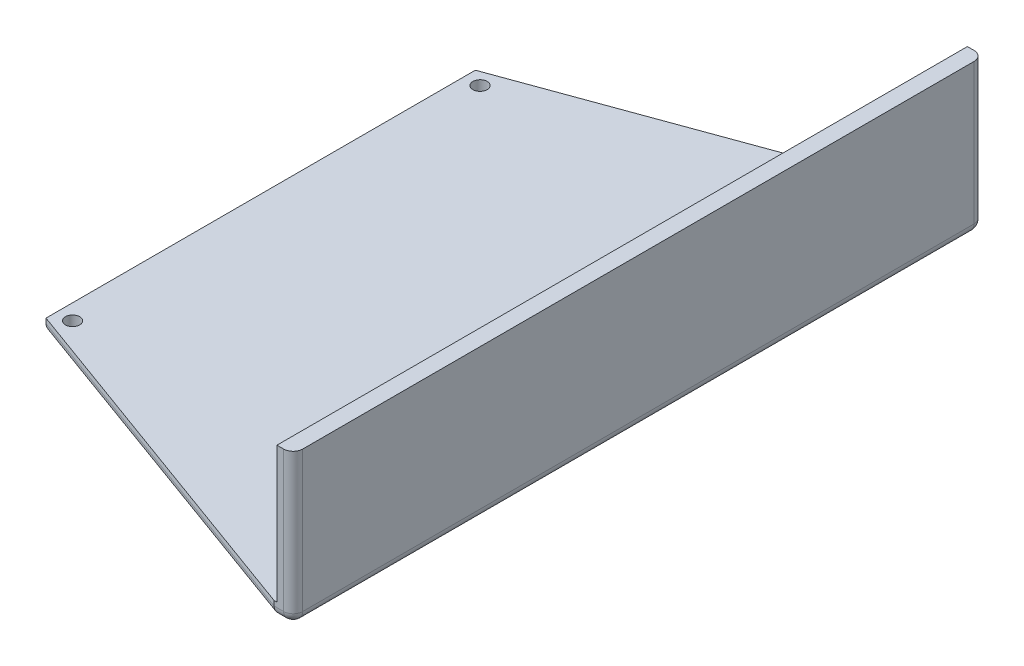
ISO-10303-21;
HEADER;
FILE_DESCRIPTION(('STEP AP214'),'2;1');
FILE_NAME('part.step','',(''),(''),'','','');
FILE_SCHEMA(('AUTOMOTIVE_DESIGN { 1 0 10303 214 1 1 1 1 }'));
ENDSEC;
DATA;
#1=APPLICATION_CONTEXT('core data for automotive mechanical design processes');
#2=APPLICATION_PROTOCOL_DEFINITION('international standard','automotive_design',2000,#1);
#3=PRODUCT_CONTEXT('',#1,'mechanical');
#4=PRODUCT('Part','Part','',(#3));
#5=PRODUCT_RELATED_PRODUCT_CATEGORY('part','',(#4));
#6=PRODUCT_DEFINITION_FORMATION('','',#4);
#7=PRODUCT_DEFINITION_CONTEXT('part definition',#1,'design');
#8=PRODUCT_DEFINITION('design','',#6,#7);
#9=PRODUCT_DEFINITION_SHAPE('','',#8);
#10=(LENGTH_UNIT() NAMED_UNIT(*) SI_UNIT(.MILLI.,.METRE.));
#11=(NAMED_UNIT(*) PLANE_ANGLE_UNIT() SI_UNIT($,.RADIAN.));
#12=(NAMED_UNIT(*) SI_UNIT($,.STERADIAN.) SOLID_ANGLE_UNIT());
#13=UNCERTAINTY_MEASURE_WITH_UNIT(LENGTH_MEASURE(1.E-05),#10,'distance_accuracy_value','');
#14=(GEOMETRIC_REPRESENTATION_CONTEXT(3) GLOBAL_UNCERTAINTY_ASSIGNED_CONTEXT((#13)) GLOBAL_UNIT_ASSIGNED_CONTEXT((#10,
#11,#12)) REPRESENTATION_CONTEXT('',''));
#15=CARTESIAN_POINT('',(0.,0.,0.));
#16=DIRECTION('',(0.,0.,1.));
#17=DIRECTION('',(1.,0.,0.));
#18=AXIS2_PLACEMENT_3D('',#15,#16,#17);
#19=CARTESIAN_POINT('',(0.,0.,0.));
#20=DIRECTION('',(0.,1.,0.));
#21=DIRECTION('',(0.,0.,1.));
#22=AXIS2_PLACEMENT_3D('',#19,#20,#21);
#23=PLANE('',#22);
#24=CARTESIAN_POINT('',(-75.8993879918341,0.,42.7056942545958));
#25=DIRECTION('',(0.,1.,0.));
#26=DIRECTION('',(0.,0.,1.));
#27=AXIS2_PLACEMENT_3D('',#24,#25,#26);
#28=CIRCLE('',#27,1.5);
#29=CARTESIAN_POINT('',(-75.5958137522718,0.,44.1746539821153));
#30=VERTEX_POINT('',#29);
#31=CARTESIAN_POINT('',(-77.17599616899,0.,41.9181210440188));
#32=VERTEX_POINT('',#31);
#33=EDGE_CURVE('E206',#30,#32,#28,.T.);
#34=ORIENTED_EDGE('',*,*,#33,.T.);
#35=DIRECTION('',(0.,0.,1.));
#36=VECTOR('',#35,1.);
#37=CARTESIAN_POINT('',(-77.17599616899,0.,0.));
#38=LINE('',#37,#36);
#39=CARTESIAN_POINT('',(-77.17599616899,0.,-41.9181210440188));
#40=VERTEX_POINT('',#39);
#41=EDGE_CURVE('E238',#32,#40,#38,.F.);
#42=ORIENTED_EDGE('',*,*,#41,.T.);
#43=CARTESIAN_POINT('',(-75.8993879918341,0.,-42.7056942545958));
#44=DIRECTION('',(0.,1.,0.));
#45=DIRECTION('',(0.,0.,1.));
#46=AXIS2_PLACEMENT_3D('',#43,#44,#45);
#47=CIRCLE('',#46,1.5);
#48=CARTESIAN_POINT('',(-75.5958137522719,0.,-44.1746539821153));
#49=VERTEX_POINT('',#48);
#50=EDGE_CURVE('E210',#40,#49,#47,.T.);
#51=ORIENTED_EDGE('',*,*,#50,.T.);
#52=DIRECTION('',(-0.939699952112375,0.,0.342));
#53=VECTOR('',#52,1.);
#54=CARTESIAN_POINT('',(-23.0387234789192,0.,-63.302594590265));
#55=LINE('',#54,#53);
#56=CARTESIAN_POINT('',(-3.64736814100806,0.,-70.36));
#57=VERTEX_POINT('',#56);
#58=EDGE_CURVE('E217',#49,#57,#55,.F.);
#59=ORIENTED_EDGE('',*,*,#58,.T.);
#60=DIRECTION('',(-1.,0.,0.));
#61=VECTOR('',#60,1.);
#62=CARTESIAN_POINT('',(0.,0.,-70.36));
#63=LINE('',#62,#61);
#64=CARTESIAN_POINT('',(-2.,0.,-70.36));
#65=VERTEX_POINT('',#64);
#66=EDGE_CURVE('E219',#57,#65,#63,.F.);
#67=ORIENTED_EDGE('',*,*,#66,.T.);
#68=DIRECTION('',(0.,0.,-1.));
#69=VECTOR('',#68,1.);
#70=CARTESIAN_POINT('',(-2.,0.,0.));
#71=LINE('',#70,#69);
#72=CARTESIAN_POINT('',(-2.,0.,70.36));
#73=VERTEX_POINT('',#72);
#74=EDGE_CURVE('E222',#65,#73,#71,.F.);
#75=ORIENTED_EDGE('',*,*,#74,.T.);
#76=DIRECTION('',(1.,0.,0.));
#77=VECTOR('',#76,1.);
#78=CARTESIAN_POINT('',(0.,0.,70.36));
#79=LINE('',#78,#77);
#80=CARTESIAN_POINT('',(-3.64736814100806,0.,70.36));
#81=VERTEX_POINT('',#80);
#82=EDGE_CURVE('E225',#73,#81,#79,.F.);
#83=ORIENTED_EDGE('',*,*,#82,.T.);
#84=DIRECTION('',(0.939699952112375,0.,0.342));
#85=VECTOR('',#84,1.);
#86=CARTESIAN_POINT('',(-23.0387234789192,0.,63.302594590265));
#87=LINE('',#86,#85);
#88=EDGE_CURVE('E227',#81,#30,#87,.F.);
#89=ORIENTED_EDGE('',*,*,#88,.T.);
#90=EDGE_LOOP('',(#34,#42,#51,#59,#67,#75,#83,#89));
#91=FACE_BOUND('',#90,.T.);
#92=ADVANCED_FACE('F36',(#91),#23,.F.);
#93=DIRECTION('',(0.939699952112375,0.,0.342));
#94=VECTOR('',#93,1.);
#95=CARTESIAN_POINT('',(-23.0387234789192,0.,63.302594590265));
#96=LINE('',#95,#94);
#97=CARTESIAN_POINT('',(-77.0761285844379,0.,43.6358993812848));
#98=VERTEX_POINT('',#97);
#99=CARTESIAN_POINT('',(-77.17599616899,0.,43.5995529774778));
#100=VERTEX_POINT('',#99);
#101=EDGE_CURVE('E233',#98,#100,#96,.F.);
#102=ORIENTED_EDGE('',*,*,#101,.T.);
#103=DIRECTION('',(0.,0.,1.));
#104=VECTOR('',#103,1.);
#105=CARTESIAN_POINT('',(-77.17599616899,0.,0.));
#106=LINE('',#105,#104);
#107=CARTESIAN_POINT('',(-77.17599616899,0.,43.4932674651728));
#108=VERTEX_POINT('',#107);
#109=EDGE_CURVE('E235',#100,#108,#106,.F.);
#110=ORIENTED_EDGE('',*,*,#109,.T.);
#111=EDGE_CURVE('E209',#108,#98,#28,.T.);
#112=ORIENTED_EDGE('',*,*,#111,.T.);
#113=EDGE_LOOP('',(#102,#110,#112));
#114=FACE_BOUND('',#113,.T.);
#115=ADVANCED_FACE('F278',(#114),#23,.F.);
#116=CARTESIAN_POINT('',(-79.17599616899,3.,-45.));
#117=DIRECTION('',(0.342,0.,0.939699952112375));
#118=DIRECTION('',(0.939699952112375,0.,-0.342));
#119=AXIS2_PLACEMENT_3D('',#116,#117,#118);
#120=PLANE('',#119);
#121=DIRECTION('',(0.,-1.,0.));
#122=VECTOR('',#121,1.);
#123=CARTESIAN_POINT('',(-4.,3.,-72.36));
#124=LINE('',#123,#122);
#125=CARTESIAN_POINT('',(-4.,3.,-72.36));
#126=VERTEX_POINT('',#125);
#127=CARTESIAN_POINT('',(-4.,2.,-72.36));
#128=VERTEX_POINT('',#127);
#129=EDGE_CURVE('E193',#126,#128,#124,.T.);
#130=ORIENTED_EDGE('',*,*,#129,.T.);
#131=DIRECTION('',(-0.939699952112375,0.,0.342));
#132=VECTOR('',#131,1.);
#133=CARTESIAN_POINT('',(-79.17599616899,2.,-45.));
#134=LINE('',#133,#132);
#135=CARTESIAN_POINT('',(-79.17599616899,2.,-45.));
#136=VERTEX_POINT('',#135);
#137=EDGE_CURVE('E324',#128,#136,#134,.T.);
#138=ORIENTED_EDGE('',*,*,#137,.T.);
#139=DIRECTION('',(0.,-1.,0.));
#140=VECTOR('',#139,1.);
#141=CARTESIAN_POINT('',(-79.17599616899,3.,-45.));
#142=LINE('',#141,#140);
#143=CARTESIAN_POINT('',(-79.17599616899,3.,-45.));
#144=VERTEX_POINT('',#143);
#145=EDGE_CURVE('E202',#144,#136,#142,.T.);
#146=ORIENTED_EDGE('',*,*,#145,.F.);
#147=DIRECTION('',(-0.939699952112375,0.,0.342));
#148=VECTOR('',#147,1.);
#149=CARTESIAN_POINT('',(-79.17599616899,3.,-45.));
#150=LINE('',#149,#148);
#151=EDGE_CURVE('E182',#126,#144,#150,.T.);
#152=ORIENTED_EDGE('',*,*,#151,.F.);
#153=EDGE_LOOP('',(#130,#138,#146,#152));
#154=FACE_BOUND('',#153,.T.);
#155=ADVANCED_FACE('F295',(#154),#120,.F.);
#156=CARTESIAN_POINT('',(-79.17599616899,3.,-45.));
#157=DIRECTION('',(1.,0.,0.));
#158=DIRECTION('',(0.,0.,-1.));
#159=AXIS2_PLACEMENT_3D('',#156,#157,#158);
#160=PLANE('',#159);
#161=ORIENTED_EDGE('',*,*,#145,.T.);
#162=DIRECTION('',(0.,0.,1.));
#163=VECTOR('',#162,1.);
#164=CARTESIAN_POINT('',(-79.17599616899,2.,-45.));
#165=LINE('',#164,#163);
#166=CARTESIAN_POINT('',(-79.17599616899,2.,45.));
#167=VERTEX_POINT('',#166);
#168=EDGE_CURVE('E205',#136,#167,#165,.T.);
#169=ORIENTED_EDGE('',*,*,#168,.T.);
#170=DIRECTION('',(0.,-1.,0.));
#171=VECTOR('',#170,1.);
#172=CARTESIAN_POINT('',(-79.17599616899,3.,45.));
#173=LINE('',#172,#171);
#174=CARTESIAN_POINT('',(-79.17599616899,3.,45.));
#175=VERTEX_POINT('',#174);
#176=EDGE_CURVE('E199',#175,#167,#173,.T.);
#177=ORIENTED_EDGE('',*,*,#176,.F.);
#178=DIRECTION('',(0.,0.,1.));
#179=VECTOR('',#178,1.);
#180=CARTESIAN_POINT('',(-79.17599616899,3.,-45.));
#181=LINE('',#180,#179);
#182=EDGE_CURVE('E185',#144,#175,#181,.T.);
#183=ORIENTED_EDGE('',*,*,#182,.F.);
#184=EDGE_LOOP('',(#161,#169,#177,#183));
#185=FACE_BOUND('',#184,.T.);
#186=ADVANCED_FACE('F291',(#185),#160,.F.);
#187=CARTESIAN_POINT('',(-79.17599616899,3.,45.));
#188=DIRECTION('',(0.342,0.,-0.939699952112375));
#189=DIRECTION('',(-0.939699952112375,0.,-0.342));
#190=AXIS2_PLACEMENT_3D('',#187,#188,#189);
#191=PLANE('',#190);
#192=ORIENTED_EDGE('',*,*,#176,.T.);
#193=DIRECTION('',(0.939699952112375,0.,0.342));
#194=VECTOR('',#193,1.);
#195=CARTESIAN_POINT('',(-79.17599616899,2.,45.));
#196=LINE('',#195,#194);
#197=CARTESIAN_POINT('',(-4.,2.,72.36));
#198=VERTEX_POINT('',#197);
#199=EDGE_CURVE('E311',#167,#198,#196,.T.);
#200=ORIENTED_EDGE('',*,*,#199,.T.);
#201=DIRECTION('',(0.,-1.,0.));
#202=VECTOR('',#201,1.);
#203=CARTESIAN_POINT('',(-4.,3.,72.36));
#204=LINE('',#203,#202);
#205=CARTESIAN_POINT('',(-4.,3.,72.36));
#206=VERTEX_POINT('',#205);
#207=EDGE_CURVE('E196',#206,#198,#204,.T.);
#208=ORIENTED_EDGE('',*,*,#207,.F.);
#209=DIRECTION('',(0.939699952112375,0.,0.342));
#210=VECTOR('',#209,1.);
#211=CARTESIAN_POINT('',(-79.17599616899,3.,45.));
#212=LINE('',#211,#210);
#213=EDGE_CURVE('E187',#175,#206,#212,.T.);
#214=ORIENTED_EDGE('',*,*,#213,.F.);
#215=EDGE_LOOP('',(#192,#200,#208,#214));
#216=FACE_BOUND('',#215,.T.);
#217=ADVANCED_FACE('F288',(#216),#191,.F.);
#218=CARTESIAN_POINT('',(-4.,3.,72.36));
#219=DIRECTION('',(0.,0.,-1.));
#220=DIRECTION('',(-1.,0.,0.));
#221=AXIS2_PLACEMENT_3D('',#218,#219,#220);
#222=PLANE('',#221);
#223=DIRECTION('',(1.,0.,0.));
#224=VECTOR('',#223,1.);
#225=CARTESIAN_POINT('',(-4.,2.,72.36));
#226=LINE('',#225,#224);
#227=CARTESIAN_POINT('',(-2.,2.,72.36));
#228=VERTEX_POINT('',#227);
#229=EDGE_CURVE('E317',#198,#228,#226,.T.);
#230=ORIENTED_EDGE('',*,*,#229,.T.);
#231=DIRECTION('',(0.,-1.,0.));
#232=VECTOR('',#231,1.);
#233=CARTESIAN_POINT('',(-2.,3.,72.36));
#234=LINE('',#233,#232);
#235=CARTESIAN_POINT('',(-2.,31.5,72.36));
#236=VERTEX_POINT('',#235);
#237=EDGE_CURVE('E61',#228,#236,#234,.F.);
#238=ORIENTED_EDGE('',*,*,#237,.T.);
#239=DIRECTION('',(-1.,0.,0.));
#240=VECTOR('',#239,1.);
#241=CARTESIAN_POINT('',(0.,31.5,72.36));
#242=LINE('',#241,#240);
#243=CARTESIAN_POINT('',(-3.4,31.5,72.36));
#244=VERTEX_POINT('',#243);
#245=EDGE_CURVE('E157',#236,#244,#242,.T.);
#246=ORIENTED_EDGE('',*,*,#245,.T.);
#247=DIRECTION('',(0.,-1.,0.));
#248=VECTOR('',#247,1.);
#249=CARTESIAN_POINT('',(-3.4,31.5,72.36));
#250=LINE('',#249,#248);
#251=CARTESIAN_POINT('',(-3.4,3.,72.36));
#252=VERTEX_POINT('',#251);
#253=EDGE_CURVE('E161',#244,#252,#250,.T.);
#254=ORIENTED_EDGE('',*,*,#253,.T.);
#255=DIRECTION('',(1.,0.,0.));
#256=VECTOR('',#255,1.);
#257=CARTESIAN_POINT('',(-4.,3.,72.36));
#258=LINE('',#257,#256);
#259=EDGE_CURVE('E189',#206,#252,#258,.T.);
#260=ORIENTED_EDGE('',*,*,#259,.F.);
#261=ORIENTED_EDGE('',*,*,#207,.T.);
#262=EDGE_LOOP('',(#230,#238,#246,#254,#260,#261));
#263=FACE_BOUND('',#262,.T.);
#264=ADVANCED_FACE('F159',(#263),#222,.F.);
#265=CARTESIAN_POINT('',(0.,3.,72.36));
#266=DIRECTION('',(-1.,0.,0.));
#267=DIRECTION('',(0.,0.,1.));
#268=AXIS2_PLACEMENT_3D('',#265,#266,#267);
#269=PLANE('',#268);
#270=DIRECTION('',(0.,0.,1.));
#271=VECTOR('',#270,1.);
#272=CARTESIAN_POINT('',(0.,31.5,-72.36));
#273=LINE('',#272,#271);
#274=CARTESIAN_POINT('',(0.,31.5,-70.36));
#275=VERTEX_POINT('',#274);
#276=CARTESIAN_POINT('',(0.,31.5,70.36));
#277=VERTEX_POINT('',#276);
#278=EDGE_CURVE('E165',#275,#277,#273,.T.);
#279=ORIENTED_EDGE('',*,*,#278,.T.);
#280=DIRECTION('',(0.,-1.,0.));
#281=VECTOR('',#280,1.);
#282=CARTESIAN_POINT('',(0.,3.,70.36));
#283=LINE('',#282,#281);
#284=CARTESIAN_POINT('',(0.,2.,70.36));
#285=VERTEX_POINT('',#284);
#286=EDGE_CURVE('E350',#277,#285,#283,.T.);
#287=ORIENTED_EDGE('',*,*,#286,.T.);
#288=DIRECTION('',(0.,0.,-1.));
#289=VECTOR('',#288,1.);
#290=CARTESIAN_POINT('',(0.,2.,72.36));
#291=LINE('',#290,#289);
#292=CARTESIAN_POINT('',(0.,2.,-70.36));
#293=VERTEX_POINT('',#292);
#294=EDGE_CURVE('E319',#285,#293,#291,.T.);
#295=ORIENTED_EDGE('',*,*,#294,.T.);
#296=DIRECTION('',(0.,-1.,0.));
#297=VECTOR('',#296,1.);
#298=CARTESIAN_POINT('',(0.,3.,-70.36));
#299=LINE('',#298,#297);
#300=EDGE_CURVE('E348',#293,#275,#299,.F.);
#301=ORIENTED_EDGE('',*,*,#300,.T.);
#302=EDGE_LOOP('',(#279,#287,#295,#301));
#303=FACE_BOUND('',#302,.T.);
#304=ADVANCED_FACE('F281',(#303),#269,.F.);
#305=CARTESIAN_POINT('',(-4.,3.,-72.36));
#306=DIRECTION('',(0.,0.,1.));
#307=DIRECTION('',(1.,0.,0.));
#308=AXIS2_PLACEMENT_3D('',#305,#306,#307);
#309=PLANE('',#308);
#310=DIRECTION('',(1.,0.,0.));
#311=VECTOR('',#310,1.);
#312=CARTESIAN_POINT('',(-3.4,31.5,-72.36));
#313=LINE('',#312,#311);
#314=CARTESIAN_POINT('',(-3.4,31.5,-72.36));
#315=VERTEX_POINT('',#314);
#316=CARTESIAN_POINT('',(-2.,31.5,-72.36));
#317=VERTEX_POINT('',#316);
#318=EDGE_CURVE('E176',#315,#317,#313,.T.);
#319=ORIENTED_EDGE('',*,*,#318,.T.);
#320=DIRECTION('',(0.,-1.,0.));
#321=VECTOR('',#320,1.);
#322=CARTESIAN_POINT('',(-2.,3.,-72.36));
#323=LINE('',#322,#321);
#324=CARTESIAN_POINT('',(-2.,2.,-72.36));
#325=VERTEX_POINT('',#324);
#326=EDGE_CURVE('E12',#317,#325,#323,.T.);
#327=ORIENTED_EDGE('',*,*,#326,.T.);
#328=DIRECTION('',(-1.,0.,0.));
#329=VECTOR('',#328,1.);
#330=CARTESIAN_POINT('',(-4.,2.,-72.36));
#331=LINE('',#330,#329);
#332=EDGE_CURVE('E322',#325,#128,#331,.T.);
#333=ORIENTED_EDGE('',*,*,#332,.T.);
#334=ORIENTED_EDGE('',*,*,#129,.F.);
#335=DIRECTION('',(-1.,0.,0.));
#336=VECTOR('',#335,1.);
#337=CARTESIAN_POINT('',(-4.,3.,-72.36));
#338=LINE('',#337,#336);
#339=CARTESIAN_POINT('',(-3.4,3.,-72.36));
#340=VERTEX_POINT('',#339);
#341=EDGE_CURVE('E191',#340,#126,#338,.T.);
#342=ORIENTED_EDGE('',*,*,#341,.F.);
#343=DIRECTION('',(0.,-1.,0.));
#344=VECTOR('',#343,1.);
#345=CARTESIAN_POINT('',(-3.4,31.5,-72.36));
#346=LINE('',#345,#344);
#347=EDGE_CURVE('E173',#315,#340,#346,.T.);
#348=ORIENTED_EDGE('',*,*,#347,.F.);
#349=EDGE_LOOP('',(#319,#327,#333,#334,#342,#348));
#350=FACE_BOUND('',#349,.T.);
#351=ADVANCED_FACE('F273',(#350),#309,.F.);
#352=CARTESIAN_POINT('',(0.,3.,0.));
#353=DIRECTION('',(0.,1.,0.));
#354=DIRECTION('',(0.,0.,1.));
#355=AXIS2_PLACEMENT_3D('',#352,#353,#354);
#356=PLANE('',#355);
#357=CARTESIAN_POINT('',(-75.8993879918341,3.,-42.7056942545958));
#358=DIRECTION('',(0.,1.,0.));
#359=DIRECTION('',(0.,0.,-1.));
#360=AXIS2_PLACEMENT_3D('',#357,#358,#359);
#361=CIRCLE('',#360,1.5);
#362=CARTESIAN_POINT('',(-75.8993879918341,3.,-44.2056942545958));
#363=VERTEX_POINT('',#362);
#364=EDGE_CURVE('E214',#363,#363,#361,.T.);
#365=ORIENTED_EDGE('',*,*,#364,.F.);
#366=EDGE_LOOP('',(#365));
#367=FACE_BOUND('',#366,.T.);
#368=CARTESIAN_POINT('',(-75.8993879918341,3.,42.7056942545958));
#369=DIRECTION('',(0.,1.,0.));
#370=DIRECTION('',(0.,0.,1.));
#371=AXIS2_PLACEMENT_3D('',#368,#369,#370);
#372=CIRCLE('',#371,1.5);
#373=CARTESIAN_POINT('',(-75.8993879918341,3.,44.2056942545958));
#374=VERTEX_POINT('',#373);
#375=EDGE_CURVE('E371',#374,#374,#372,.T.);
#376=ORIENTED_EDGE('',*,*,#375,.F.);
#377=EDGE_LOOP('',(#376));
#378=FACE_BOUND('',#377,.T.);
#379=DIRECTION('',(0.,0.,1.));
#380=VECTOR('',#379,1.);
#381=CARTESIAN_POINT('',(-3.4,3.,0.));
#382=LINE('',#381,#380);
#383=EDGE_CURVE('E172',#340,#252,#382,.T.);
#384=ORIENTED_EDGE('',*,*,#383,.F.);
#385=ORIENTED_EDGE('',*,*,#341,.T.);
#386=ORIENTED_EDGE('',*,*,#151,.T.);
#387=ORIENTED_EDGE('',*,*,#182,.T.);
#388=ORIENTED_EDGE('',*,*,#213,.T.);
#389=ORIENTED_EDGE('',*,*,#259,.T.);
#390=EDGE_LOOP('',(#384,#385,#386,#387,#388,#389));
#391=FACE_BOUND('',#390,.T.);
#392=ADVANCED_FACE('F270',(#367,#378,#391),#356,.T.);
#393=CARTESIAN_POINT('',(-77.0761285844378,0.,-43.6358993812848));
#394=VERTEX_POINT('',#393);
#395=CARTESIAN_POINT('',(-77.17599616899,0.,-43.4932674651728));
#396=VERTEX_POINT('',#395);
#397=EDGE_CURVE('E213',#394,#396,#47,.T.);
#398=ORIENTED_EDGE('',*,*,#397,.T.);
#399=DIRECTION('',(0.,0.,1.));
#400=VECTOR('',#399,1.);
#401=CARTESIAN_POINT('',(-77.17599616899,0.,0.));
#402=LINE('',#401,#400);
#403=CARTESIAN_POINT('',(-77.17599616899,0.,-43.5995529774778));
#404=VERTEX_POINT('',#403);
#405=EDGE_CURVE('E231',#396,#404,#402,.F.);
#406=ORIENTED_EDGE('',*,*,#405,.T.);
#407=DIRECTION('',(-0.939699952112375,0.,0.342));
#408=VECTOR('',#407,1.);
#409=CARTESIAN_POINT('',(-23.0387234789192,0.,-63.302594590265));
#410=LINE('',#409,#408);
#411=EDGE_CURVE('E229',#404,#394,#410,.F.);
#412=ORIENTED_EDGE('',*,*,#411,.T.);
#413=EDGE_LOOP('',(#398,#406,#412));
#414=FACE_BOUND('',#413,.T.);
#415=ADVANCED_FACE('F269',(#414),#23,.F.);
#416=CARTESIAN_POINT('',(-3.4,31.5,-72.36));
#417=DIRECTION('',(-1.,0.,0.));
#418=DIRECTION('',(0.,0.,1.));
#419=AXIS2_PLACEMENT_3D('',#416,#417,#418);
#420=PLANE('',#419);
#421=ORIENTED_EDGE('',*,*,#347,.T.);
#422=ORIENTED_EDGE('',*,*,#383,.T.);
#423=ORIENTED_EDGE('',*,*,#253,.F.);
#424=DIRECTION('',(0.,0.,-1.));
#425=VECTOR('',#424,1.);
#426=CARTESIAN_POINT('',(-3.4,31.5,-72.36));
#427=LINE('',#426,#425);
#428=EDGE_CURVE('E164',#244,#315,#427,.T.);
#429=ORIENTED_EDGE('',*,*,#428,.T.);
#430=EDGE_LOOP('',(#421,#422,#423,#429));
#431=FACE_BOUND('',#430,.T.);
#432=ADVANCED_FACE('F171',(#431),#420,.T.);
#433=CARTESIAN_POINT('',(0.,31.5,0.));
#434=DIRECTION('',(0.,-1.,0.));
#435=DIRECTION('',(0.,0.,-1.));
#436=AXIS2_PLACEMENT_3D('',#433,#434,#435);
#437=PLANE('',#436);
#438=ORIENTED_EDGE('',*,*,#245,.F.);
#439=CARTESIAN_POINT('',(-2.,31.5,70.36));
#440=DIRECTION('',(0.,-1.,0.));
#441=DIRECTION('',(0.,0.,-1.));
#442=AXIS2_PLACEMENT_3D('',#439,#440,#441);
#443=CIRCLE('',#442,2.);
#444=EDGE_CURVE('E45',#236,#277,#443,.F.);
#445=ORIENTED_EDGE('',*,*,#444,.T.);
#446=ORIENTED_EDGE('',*,*,#278,.F.);
#447=CARTESIAN_POINT('',(-2.,31.5,-70.36));
#448=DIRECTION('',(0.,-1.,0.));
#449=DIRECTION('',(0.,0.,-1.));
#450=AXIS2_PLACEMENT_3D('',#447,#448,#449);
#451=CIRCLE('',#450,2.);
#452=EDGE_CURVE('E53',#275,#317,#451,.F.);
#453=ORIENTED_EDGE('',*,*,#452,.T.);
#454=ORIENTED_EDGE('',*,*,#318,.F.);
#455=ORIENTED_EDGE('',*,*,#428,.F.);
#456=EDGE_LOOP('',(#438,#445,#446,#453,#454,#455));
#457=FACE_BOUND('',#456,.T.);
#458=ADVANCED_FACE('F175',(#457),#437,.F.);
#459=CARTESIAN_POINT('',(-75.8993879918341,-37.,42.7056942545958));
#460=DIRECTION('',(0.,1.,0.));
#461=DIRECTION('',(0.,0.,1.));
#462=AXIS2_PLACEMENT_3D('',#459,#460,#461);
#463=CYLINDRICAL_SURFACE('',#462,1.5);
#464=ORIENTED_EDGE('',*,*,#375,.T.);
#465=EDGE_LOOP('',(#464));
#466=FACE_BOUND('',#465,.T.);
#467=ORIENTED_EDGE('',*,*,#111,.F.);
#468=CARTESIAN_POINT('',(-77.17599616899,0.,43.4932674651728));
#469=CARTESIAN_POINT('',(-77.1981292311895,3.68964176767819E-06,43.4573906466076));
#470=CARTESIAN_POINT('',(-77.2187369457272,0.000366723444671953,43.4206007835315));
#471=CARTESIAN_POINT('',(-77.2567814777888,0.00154106792686863,43.3454278661987));
#472=CARTESIAN_POINT('',(-77.2742186357116,0.0023523304453832,43.3070449835166));
#473=CARTESIAN_POINT('',(-77.3215486487085,0.00505012635717781,43.1899728630402));
#474=CARTESIAN_POINT('',(-77.3465336955682,0.00720246183369997,43.1092404803857));
#475=CARTESIAN_POINT('',(-77.382617457514,0.0106183319414506,42.9447220509118));
#476=CARTESIAN_POINT('',(-77.3937113226948,0.0118815560849511,42.8609349480821));
#477=CARTESIAN_POINT('',(-77.4016926464659,0.0127711476946285,42.6926531228798));
#478=CARTESIAN_POINT('',(-77.3985788175457,0.0123973668144648,42.608158337069));
#479=CARTESIAN_POINT('',(-77.3782697451303,0.0102294793332169,42.4411753063135));
#480=CARTESIAN_POINT('',(-77.3611161066299,0.0084395697517977,42.3586818733549));
#481=CARTESIAN_POINT('',(-77.3132679312557,0.0045736471124433,42.1977923882661));
#482=CARTESIAN_POINT('',(-77.2825932943215,0.00249805758874565,42.1193905032297));
#483=CARTESIAN_POINT('',(-77.2350448383638,0.000844466252313037,42.0226115198095));
#484=CARTESIAN_POINT('',(-77.2239289647224,0.000540909911812322,42.0013005707086));
#485=CARTESIAN_POINT('',(-77.2007042715681,0.000118731951890991,41.9592696534399));
#486=CARTESIAN_POINT('',(-77.1885970767045,-1.86123631627575E-07,41.9385487904583));
#487=CARTESIAN_POINT('',(-77.17599616899,0.,41.9181210440188));
#488=B_SPLINE_CURVE_WITH_KNOTS('',3,(#468,#469,#470,#471,#472,#473,#474,#475,#476,#477,#478,
#479,#480,#481,#482,#483,#484,#485,#486,#487),.UNSPECIFIED.,.F.,.F.,(4,2,2,2,2,2,2,2,2,4),(0.,
0.126380021366296,0.252746466233381,0.505063134202165,0.757467870345467,1.00989548002496,
1.26157775289015,1.51289083516444,1.58498500923719,1.65696330840681),.UNSPECIFIED.);
#489=EDGE_CURVE('E247',#108,#32,#488,.T.);
#490=ORIENTED_EDGE('',*,*,#489,.T.);
#491=ORIENTED_EDGE('',*,*,#33,.F.);
#492=CARTESIAN_POINT('',(-75.5958137522718,0.,44.1746539821153));
#493=CARTESIAN_POINT('',(-75.637096140922,3.68887780878096E-06,44.1831851192859));
#494=CARTESIAN_POINT('',(-75.6787149559088,0.000366797383812305,44.1899706492644));
#495=CARTESIAN_POINT('',(-75.7623654755297,0.00154141666737172,44.2000171769816));
#496=CARTESIAN_POINT('',(-75.8043971353095,0.00235287925055075,44.2032785534266));
#497=CARTESIAN_POINT('',(-75.9305963213471,0.00505142550282026,44.2077237951508));
#498=CARTESIAN_POINT('',(-76.0150056469113,0.00720446090414906,44.203597054269));
#499=CARTESIAN_POINT('',(-76.1819455864548,0.0106218361634221,44.181250127568));
#500=CARTESIAN_POINT('',(-76.264475534533,0.0118858656275553,44.163025024006));
#501=CARTESIAN_POINT('',(-76.4253426101416,0.0127768150325083,44.1129828082583));
#502=CARTESIAN_POINT('',(-76.503679359608,0.0124035876070029,44.0811644728046));
#503=CARTESIAN_POINT('',(-76.6536521528777,0.0102361992499131,44.0049813874131));
#504=CARTESIAN_POINT('',(-76.7253073085286,0.00844623936375754,43.9606539803751));
#505=CARTESIAN_POINT('',(-76.8601371405721,0.00457930443904358,43.8606755751332));
#506=CARTESIAN_POINT('',(-76.9233240897327,0.00250275381312597,43.8050412648023));
#507=CARTESIAN_POINT('',(-76.9980324550739,0.000846725104473812,43.7272436173057));
#508=CARTESIAN_POINT('',(-77.0142785762662,0.000542374055014828,43.7094869392417));
#509=CARTESIAN_POINT('',(-77.0458735536659,0.000119067747257816,43.673240691586));
#510=CARTESIAN_POINT('',(-77.0612238110843,-1.84931327968212E-07,43.6547523467858));
#511=CARTESIAN_POINT('',(-77.0761285844379,0.,43.6358993812848));
#512=B_SPLINE_CURVE_WITH_KNOTS('',3,(#492,#493,#494,#495,#496,#497,#498,#499,#500,#501,#502,
#503,#504,#505,#506,#507,#508,#509,#510,#511),.UNSPECIFIED.,.F.,.F.,(4,2,2,2,2,2,2,2,2,4),(0.,
0.126379925302598,0.252746268444468,0.505062887125117,0.757467557736866,1.00989494727083,
1.26157660403332,1.51288946640445,1.58507817228334,1.65715076317813),.UNSPECIFIED.);
#513=EDGE_CURVE('E240',#30,#98,#512,.T.);
#514=ORIENTED_EDGE('',*,*,#513,.T.);
#515=EDGE_LOOP('',(#467,#490,#491,#514));
#516=FACE_BOUND('',#515,.T.);
#517=ADVANCED_FACE('F256',(#466,#516),#463,.F.);
#518=CARTESIAN_POINT('',(-75.8993879918341,-37.,-42.7056942545958));
#519=DIRECTION('',(0.,1.,0.));
#520=DIRECTION('',(0.,0.,1.));
#521=AXIS2_PLACEMENT_3D('',#518,#519,#520);
#522=CYLINDRICAL_SURFACE('',#521,1.5);
#523=ORIENTED_EDGE('',*,*,#364,.T.);
#524=EDGE_LOOP('',(#523));
#525=FACE_BOUND('',#524,.T.);
#526=ORIENTED_EDGE('',*,*,#50,.F.);
#527=CARTESIAN_POINT('',(-77.17599616899,0.,-41.9181210440188));
#528=CARTESIAN_POINT('',(-77.1981292311894,3.68964176724162E-06,-41.9539978625839));
#529=CARTESIAN_POINT('',(-77.2187369457272,0.000366723444671672,-41.99078772566));
#530=CARTESIAN_POINT('',(-77.2567814777888,0.001541067926869,-42.0659606429929));
#531=CARTESIAN_POINT('',(-77.2742186357116,0.00235233044538406,-42.104343525675));
#532=CARTESIAN_POINT('',(-77.3215486487085,0.00505012635717942,-42.2214156461514));
#533=CARTESIAN_POINT('',(-77.3465336955682,0.0072024618337011,-42.3021480288059));
#534=CARTESIAN_POINT('',(-77.382617457514,0.0106183319414512,-42.4666664582798));
#535=CARTESIAN_POINT('',(-77.3937113226948,0.0118815560849518,-42.5504535611094));
#536=CARTESIAN_POINT('',(-77.4016926464659,0.0127711476946296,-42.7187353863117));
#537=CARTESIAN_POINT('',(-77.3985788175458,0.0123973668144664,-42.8032301721225));
#538=CARTESIAN_POINT('',(-77.3782697451303,0.0102294793332188,-42.9702132028781));
#539=CARTESIAN_POINT('',(-77.3611161066299,0.00843956975179945,-43.0527066358366));
#540=CARTESIAN_POINT('',(-77.3132679312557,0.00457364711244479,-43.2135961209254));
#541=CARTESIAN_POINT('',(-77.2825932943215,0.00249805758874704,-43.2919980059619));
#542=CARTESIAN_POINT('',(-77.2350448383638,0.000844466252313151,-43.3887769893821));
#543=CARTESIAN_POINT('',(-77.2239289647224,0.000540909911812052,-43.410087938483));
#544=CARTESIAN_POINT('',(-77.2007042715681,0.000118731951890374,-43.4521188557517));
#545=CARTESIAN_POINT('',(-77.1885970767045,-1.86123632208242E-07,-43.4728397187333));
#546=CARTESIAN_POINT('',(-77.17599616899,0.,-43.4932674651728));
#547=B_SPLINE_CURVE_WITH_KNOTS('',3,(#527,#528,#529,#530,#531,#532,#533,#534,#535,#536,#537,
#538,#539,#540,#541,#542,#543,#544,#545,#546),.UNSPECIFIED.,.F.,.F.,(4,2,2,2,2,2,2,2,2,4),(0.,
0.126380021366296,0.252746466233381,0.505063134202167,0.757467870345471,1.00989548002496,
1.26157775289015,1.51289083516445,1.58498500923722,1.65696330840686),.UNSPECIFIED.);
#548=EDGE_CURVE('E306',#40,#396,#547,.T.);
#549=ORIENTED_EDGE('',*,*,#548,.T.);
#550=ORIENTED_EDGE('',*,*,#397,.F.);
#551=CARTESIAN_POINT('',(-77.0761285844378,0.,-43.6358993812848));
#552=CARTESIAN_POINT('',(-77.0499867314862,3.68887780960064E-06,-43.6689692987075));
#553=CARTESIAN_POINT('',(-77.0224651543936,0.000366797383813345,-43.700918194969));
#554=CARTESIAN_POINT('',(-76.9648402871111,0.00154141666737267,-43.7623813288193));
#555=CARTESIAN_POINT('',(-76.9347372746981,0.00235287925055132,-43.7918958276939));
#556=CARTESIAN_POINT('',(-76.8409168121616,0.00505142550282024,-43.8764163313601));
#557=CARTESIAN_POINT('',(-76.773600708933,0.00720446090414931,-43.9275094471256));
#558=CARTESIAN_POINT('',(-76.6313491018968,0.0106218361634219,-44.0176915342791));
#559=CARTESIAN_POINT('',(-76.5564109473147,0.0118858656275544,-44.0567763103109));
#560=CARTESIAN_POINT('',(-76.4010103122336,0.0127768150325072,-44.1218384497488));
#561=CARTESIAN_POINT('',(-76.3205473350978,0.0124035876070022,-44.1478146330411));
#562=CARTESIAN_POINT('',(-76.1566903360932,0.0102361992499126,-44.1858486322801));
#563=CARTESIAN_POINT('',(-76.0733056755002,0.00844623936375671,-44.197947339808));
#564=CARTESIAN_POINT('',(-75.9057547198162,0.00457930443904273,-44.2080192002603));
#565=CARTESIAN_POINT('',(-75.8215897491113,0.00250275381312537,-44.2060130256772));
#566=CARTESIAN_POINT('',(-75.7143529534487,0.000846725104473631,-44.1944335842402));
#567=CARTESIAN_POINT('',(-75.6904940654186,0.000542374055014809,-44.191272962208));
#568=CARTESIAN_POINT('',(-75.6429925894168,0.000119067747258023,-44.1838135491186));
#569=CARTESIAN_POINT('',(-75.6193497152569,-1.84931327760672E-07,-44.1795165969749));
#570=CARTESIAN_POINT('',(-75.5958137522719,0.,-44.1746539821153));
#571=B_SPLINE_CURVE_WITH_KNOTS('',3,(#551,#552,#553,#554,#555,#556,#557,#558,#559,#560,#561,
#562,#563,#564,#565,#566,#567,#568,#569,#570),.UNSPECIFIED.,.F.,.F.,(4,2,2,2,2,2,2,2,2,4),(0.,
0.126379925302604,0.252746268444462,0.505062887125105,0.757467557736839,1.00989494727081,
1.26157660403331,1.51288946640443,1.58507817228328,1.65715076317801),.UNSPECIFIED.);
#572=EDGE_CURVE('E312',#394,#49,#571,.T.);
#573=ORIENTED_EDGE('',*,*,#572,.T.);
#574=EDGE_LOOP('',(#526,#549,#550,#573));
#575=FACE_BOUND('',#574,.T.);
#576=ADVANCED_FACE('F261',(#525,#575),#522,.F.);
#577=CARTESIAN_POINT('',(-2.,2.,72.36));
#578=DIRECTION('',(0.,0.,-1.));
#579=DIRECTION('',(-1.,0.,0.));
#580=AXIS2_PLACEMENT_3D('',#577,#578,#579);
#581=CYLINDRICAL_SURFACE('',#580,2.);
#582=ORIENTED_EDGE('',*,*,#294,.F.);
#583=CARTESIAN_POINT('',(-2.,2.,70.36));
#584=DIRECTION('',(0.,0.,-1.));
#585=DIRECTION('',(-1.,0.,0.));
#586=AXIS2_PLACEMENT_3D('',#583,#584,#585);
#587=CIRCLE('',#586,2.);
#588=EDGE_CURVE('E343',#285,#73,#587,.T.);
#589=ORIENTED_EDGE('',*,*,#588,.T.);
#590=ORIENTED_EDGE('',*,*,#74,.F.);
#591=CARTESIAN_POINT('',(-2.,2.,-70.36));
#592=DIRECTION('',(0.,0.,-1.));
#593=DIRECTION('',(-1.,0.,0.));
#594=AXIS2_PLACEMENT_3D('',#591,#592,#593);
#595=CIRCLE('',#594,2.);
#596=EDGE_CURVE('E341',#65,#293,#595,.F.);
#597=ORIENTED_EDGE('',*,*,#596,.T.);
#598=EDGE_LOOP('',(#582,#589,#590,#597));
#599=FACE_BOUND('',#598,.T.);
#600=ADVANCED_FACE('F425',(#599),#581,.T.);
#601=CARTESIAN_POINT('',(-4.,2.,-70.36));
#602=DIRECTION('',(-1.,0.,0.));
#603=DIRECTION('',(0.,0.,1.));
#604=AXIS2_PLACEMENT_3D('',#601,#602,#603);
#605=CYLINDRICAL_SURFACE('',#604,2.);
#606=ORIENTED_EDGE('',*,*,#332,.F.);
#607=CARTESIAN_POINT('',(-2.,2.,-70.36));
#608=DIRECTION('',(-1.,0.,0.));
#609=DIRECTION('',(0.,0.,1.));
#610=AXIS2_PLACEMENT_3D('',#607,#608,#609);
#611=CIRCLE('',#610,2.);
#612=EDGE_CURVE('E345',#325,#65,#611,.T.);
#613=ORIENTED_EDGE('',*,*,#612,.T.);
#614=ORIENTED_EDGE('',*,*,#66,.F.);
#615=CARTESIAN_POINT('',(-3.64736814100799,2.,-70.36));
#616=DIRECTION('',(-0.984809614116448,0.,0.173637622489518));
#617=DIRECTION('',(0.173637622489518,0.,0.984809614116448));
#618=AXIS2_PLACEMENT_3D('',#615,#616,#617);
#619=ELLIPSE('',#618,2.03084938584232,2.);
#620=EDGE_CURVE('E336',#128,#57,#619,.T.);
#621=ORIENTED_EDGE('',*,*,#620,.F.);
#622=EDGE_LOOP('',(#606,#613,#614,#621));
#623=FACE_BOUND('',#622,.T.);
#624=ADVANCED_FACE('F422',(#623),#605,.T.);
#625=CARTESIAN_POINT('',(-4.,2.,70.36));
#626=DIRECTION('',(1.,0.,0.));
#627=DIRECTION('',(0.,0.,-1.));
#628=AXIS2_PLACEMENT_3D('',#625,#626,#627);
#629=CYLINDRICAL_SURFACE('',#628,2.);
#630=ORIENTED_EDGE('',*,*,#82,.F.);
#631=CARTESIAN_POINT('',(-2.,2.,70.36));
#632=DIRECTION('',(1.,0.,0.));
#633=DIRECTION('',(0.,0.,-1.));
#634=AXIS2_PLACEMENT_3D('',#631,#632,#633);
#635=CIRCLE('',#634,2.);
#636=EDGE_CURVE('E326',#73,#228,#635,.F.);
#637=ORIENTED_EDGE('',*,*,#636,.T.);
#638=ORIENTED_EDGE('',*,*,#229,.F.);
#639=CARTESIAN_POINT('',(-3.64736814100785,2.,70.36));
#640=DIRECTION('',(0.984809614116448,0.,0.173637622489518));
#641=DIRECTION('',(0.173637622489518,0.,-0.984809614116448));
#642=AXIS2_PLACEMENT_3D('',#639,#640,#641);
#643=ELLIPSE('',#642,2.03084938584232,2.);
#644=EDGE_CURVE('E333',#81,#198,#643,.F.);
#645=ORIENTED_EDGE('',*,*,#644,.F.);
#646=EDGE_LOOP('',(#630,#637,#638,#645));
#647=FACE_BOUND('',#646,.T.);
#648=ADVANCED_FACE('F396',(#647),#629,.T.);
#649=CARTESIAN_POINT('',(-78.49199616899,2.,-43.1206000957753));
#650=DIRECTION('',(-0.939699952112375,0.,0.342));
#651=DIRECTION('',(0.342,0.,0.939699952112375));
#652=AXIS2_PLACEMENT_3D('',#649,#650,#651);
#653=CYLINDRICAL_SURFACE('',#652,2.);
#654=ORIENTED_EDGE('',*,*,#572,.F.);
#655=ORIENTED_EDGE('',*,*,#411,.F.);
#656=CARTESIAN_POINT('',(-77.17599616899,2.,-43.5995529774778));
#657=DIRECTION('',(-0.573585215987999,0.,0.819145896650896));
#658=DIRECTION('',(-0.819145896650896,0.,-0.573585215987999));
#659=AXIS2_PLACEMENT_3D('',#656,#657,#658);
#660=ELLIPSE('',#659,2.44156750119492,2.);
#661=EDGE_CURVE('E329',#136,#404,#660,.T.);
#662=ORIENTED_EDGE('',*,*,#661,.F.);
#663=ORIENTED_EDGE('',*,*,#137,.F.);
#664=ORIENTED_EDGE('',*,*,#620,.T.);
#665=ORIENTED_EDGE('',*,*,#58,.F.);
#666=EDGE_LOOP('',(#654,#655,#662,#663,#664,#665));
#667=FACE_BOUND('',#666,.T.);
#668=ADVANCED_FACE('F418',(#667),#653,.T.);
#669=CARTESIAN_POINT('',(-78.49199616899,2.,43.1206000957753));
#670=DIRECTION('',(0.939699952112375,0.,0.342));
#671=DIRECTION('',(0.342,0.,-0.939699952112375));
#672=AXIS2_PLACEMENT_3D('',#669,#670,#671);
#673=CYLINDRICAL_SURFACE('',#672,2.);
#674=ORIENTED_EDGE('',*,*,#644,.T.);
#675=ORIENTED_EDGE('',*,*,#199,.F.);
#676=CARTESIAN_POINT('',(-77.17599616899,2.,43.5995529774778));
#677=DIRECTION('',(0.573585215987999,0.,0.819145896650896));
#678=DIRECTION('',(0.819145896650896,0.,-0.573585215987999));
#679=AXIS2_PLACEMENT_3D('',#676,#677,#678);
#680=ELLIPSE('',#679,2.44156750119492,2.);
#681=EDGE_CURVE('E327',#100,#167,#680,.F.);
#682=ORIENTED_EDGE('',*,*,#681,.F.);
#683=ORIENTED_EDGE('',*,*,#101,.F.);
#684=ORIENTED_EDGE('',*,*,#513,.F.);
#685=ORIENTED_EDGE('',*,*,#88,.F.);
#686=EDGE_LOOP('',(#674,#675,#682,#683,#684,#685));
#687=FACE_BOUND('',#686,.T.);
#688=ADVANCED_FACE('F253',(#687),#673,.T.);
#689=CARTESIAN_POINT('',(-77.17599616899,2.,-45.));
#690=DIRECTION('',(0.,0.,1.));
#691=DIRECTION('',(1.,0.,0.));
#692=AXIS2_PLACEMENT_3D('',#689,#690,#691);
#693=CYLINDRICAL_SURFACE('',#692,2.);
#694=ORIENTED_EDGE('',*,*,#489,.F.);
#695=ORIENTED_EDGE('',*,*,#109,.F.);
#696=ORIENTED_EDGE('',*,*,#681,.T.);
#697=ORIENTED_EDGE('',*,*,#168,.F.);
#698=ORIENTED_EDGE('',*,*,#661,.T.);
#699=ORIENTED_EDGE('',*,*,#405,.F.);
#700=ORIENTED_EDGE('',*,*,#548,.F.);
#701=ORIENTED_EDGE('',*,*,#41,.F.);
#702=EDGE_LOOP('',(#694,#695,#696,#697,#698,#699,#700,#701));
#703=FACE_BOUND('',#702,.T.);
#704=ADVANCED_FACE('F299',(#703),#693,.T.);
#705=CARTESIAN_POINT('',(-2.,3.,70.36));
#706=DIRECTION('',(0.,-1.,0.));
#707=DIRECTION('',(0.,0.,-1.));
#708=AXIS2_PLACEMENT_3D('',#705,#706,#707);
#709=CYLINDRICAL_SURFACE('',#708,2.);
#710=ORIENTED_EDGE('',*,*,#444,.F.);
#711=ORIENTED_EDGE('',*,*,#237,.F.);
#712=CARTESIAN_POINT('',(-2.,2.,70.36));
#713=DIRECTION('',(0.,-1.,0.));
#714=DIRECTION('',(0.,0.,-1.));
#715=AXIS2_PLACEMENT_3D('',#712,#713,#714);
#716=CIRCLE('',#715,2.);
#717=EDGE_CURVE('E330',#285,#228,#716,.T.);
#718=ORIENTED_EDGE('',*,*,#717,.F.);
#719=ORIENTED_EDGE('',*,*,#286,.F.);
#720=EDGE_LOOP('',(#710,#711,#718,#719));
#721=FACE_BOUND('',#720,.T.);
#722=ADVANCED_FACE('F302',(#721),#709,.T.);
#723=CARTESIAN_POINT('',(-2.,2.,70.36));
#724=DIRECTION('',(0.,0.,1.));
#725=DIRECTION('',(1.,0.,0.));
#726=AXIS2_PLACEMENT_3D('',#723,#724,#725);
#727=SPHERICAL_SURFACE('',#726,2.);
#728=ORIENTED_EDGE('',*,*,#636,.F.);
#729=ORIENTED_EDGE('',*,*,#588,.F.);
#730=ORIENTED_EDGE('',*,*,#717,.T.);
#731=EDGE_LOOP('',(#728,#729,#730));
#732=FACE_BOUND('',#731,.T.);
#733=ADVANCED_FACE('F426',(#732),#727,.T.);
#734=CARTESIAN_POINT('',(-2.,3.,-70.36));
#735=DIRECTION('',(0.,-1.,0.));
#736=DIRECTION('',(0.,0.,-1.));
#737=AXIS2_PLACEMENT_3D('',#734,#735,#736);
#738=CYLINDRICAL_SURFACE('',#737,2.);
#739=ORIENTED_EDGE('',*,*,#452,.F.);
#740=ORIENTED_EDGE('',*,*,#300,.F.);
#741=CARTESIAN_POINT('',(-2.,2.,-70.36));
#742=DIRECTION('',(0.,-1.,0.));
#743=DIRECTION('',(0.,0.,-1.));
#744=AXIS2_PLACEMENT_3D('',#741,#742,#743);
#745=CIRCLE('',#744,2.);
#746=EDGE_CURVE('E40',#325,#293,#745,.T.);
#747=ORIENTED_EDGE('',*,*,#746,.F.);
#748=ORIENTED_EDGE('',*,*,#326,.F.);
#749=EDGE_LOOP('',(#739,#740,#747,#748));
#750=FACE_BOUND('',#749,.T.);
#751=ADVANCED_FACE('F38',(#750),#738,.T.);
#752=CARTESIAN_POINT('',(-2.,2.,-70.36));
#753=DIRECTION('',(0.,0.,1.));
#754=DIRECTION('',(1.,0.,0.));
#755=AXIS2_PLACEMENT_3D('',#752,#753,#754);
#756=SPHERICAL_SURFACE('',#755,2.);
#757=ORIENTED_EDGE('',*,*,#746,.T.);
#758=ORIENTED_EDGE('',*,*,#596,.F.);
#759=ORIENTED_EDGE('',*,*,#612,.F.);
#760=EDGE_LOOP('',(#757,#758,#759));
#761=FACE_BOUND('',#760,.T.);
#762=ADVANCED_FACE('F362',(#761),#756,.T.);
#763=CLOSED_SHELL('',(#92,#115,#155,#186,#217,#264,#304,#351,#392,#415,#432,#458,#517,#576,#600,
#624,#648,#668,#688,#704,#722,#733,#751,#762));
#764=MANIFOLD_SOLID_BREP('B2',#763);
#765=ADVANCED_BREP_SHAPE_REPRESENTATION('',(#18,#764),#14);
#766=SHAPE_DEFINITION_REPRESENTATION(#9,#765);
ENDSEC;
END-ISO-10303-21;
